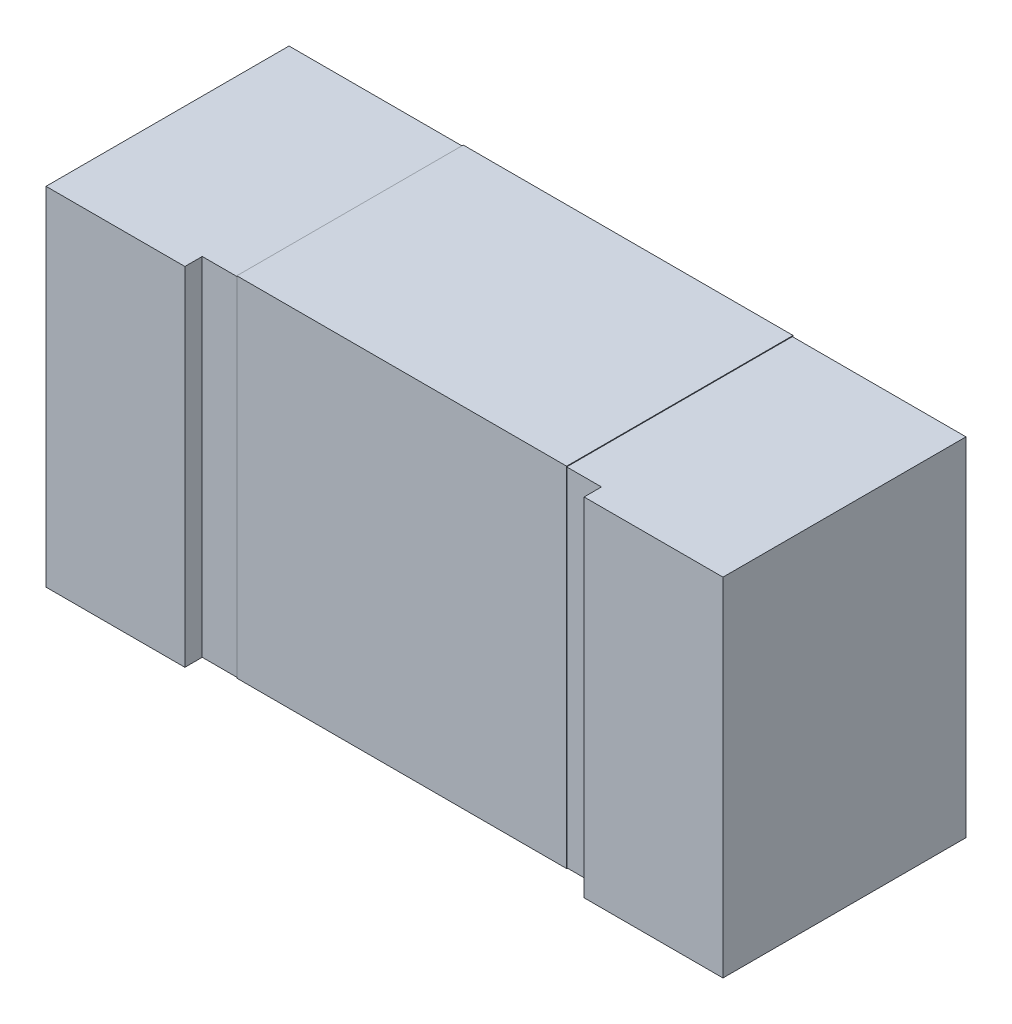
ISO-10303-21;
HEADER;
FILE_DESCRIPTION(('STEP AP214'),'2;1');
FILE_NAME('part.step','',(''),(''),'','','');
FILE_SCHEMA(('AUTOMOTIVE_DESIGN { 1 0 10303 214 1 1 1 1 }'));
ENDSEC;
DATA;
#1=APPLICATION_CONTEXT('core data for automotive mechanical design processes');
#2=APPLICATION_PROTOCOL_DEFINITION('international standard','automotive_design',2000,#1);
#3=PRODUCT_CONTEXT('',#1,'mechanical');
#4=PRODUCT('Part','Part','',(#3));
#5=PRODUCT_RELATED_PRODUCT_CATEGORY('part','',(#4));
#6=PRODUCT_DEFINITION_FORMATION('','',#4);
#7=PRODUCT_DEFINITION_CONTEXT('part definition',#1,'design');
#8=PRODUCT_DEFINITION('design','',#6,#7);
#9=PRODUCT_DEFINITION_SHAPE('','',#8);
#10=(LENGTH_UNIT() NAMED_UNIT(*) SI_UNIT(.MILLI.,.METRE.));
#11=(NAMED_UNIT(*) PLANE_ANGLE_UNIT() SI_UNIT($,.RADIAN.));
#12=(NAMED_UNIT(*) SI_UNIT($,.STERADIAN.) SOLID_ANGLE_UNIT());
#13=UNCERTAINTY_MEASURE_WITH_UNIT(LENGTH_MEASURE(1.E-05),#10,'distance_accuracy_value','');
#14=(GEOMETRIC_REPRESENTATION_CONTEXT(3) GLOBAL_UNCERTAINTY_ASSIGNED_CONTEXT((#13)) GLOBAL_UNIT_ASSIGNED_CONTEXT((#10,
#11,#12)) REPRESENTATION_CONTEXT('',''));
#15=CARTESIAN_POINT('',(0.,0.,0.));
#16=DIRECTION('',(0.,0.,1.));
#17=DIRECTION('',(1.,0.,0.));
#18=AXIS2_PLACEMENT_3D('',#15,#16,#17);
#19=CARTESIAN_POINT('',(-0.4699,-0.254,0.3302));
#20=DIRECTION('',(0.,0.,1.));
#21=DIRECTION('',(1.,0.,0.));
#22=AXIS2_PLACEMENT_3D('',#19,#20,#21);
#23=PLANE('',#22);
#24=DIRECTION('',(1.,0.,0.));
#25=VECTOR('',#24,1.);
#26=CARTESIAN_POINT('',(-0.4699,0.254,0.3302));
#27=LINE('',#26,#25);
#28=CARTESIAN_POINT('',(0.2413,0.254,0.3302));
#29=VERTEX_POINT('',#28);
#30=CARTESIAN_POINT('',(0.2921,0.254,0.3302));
#31=VERTEX_POINT('',#30);
#32=EDGE_CURVE('E227',#29,#31,#27,.T.);
#33=ORIENTED_EDGE('',*,*,#32,.F.);
#34=DIRECTION('',(0.,-1.,0.));
#35=VECTOR('',#34,1.);
#36=CARTESIAN_POINT('',(0.2413,-0.254,0.3302));
#37=LINE('',#36,#35);
#38=CARTESIAN_POINT('',(0.2413,-0.254,0.3302));
#39=VERTEX_POINT('',#38);
#40=EDGE_CURVE('E172',#29,#39,#37,.T.);
#41=ORIENTED_EDGE('',*,*,#40,.T.);
#42=DIRECTION('',(1.,0.,0.));
#43=VECTOR('',#42,1.);
#44=CARTESIAN_POINT('',(-0.4699,-0.254,0.3302));
#45=LINE('',#44,#43);
#46=CARTESIAN_POINT('',(0.2921,-0.254,0.3302));
#47=VERTEX_POINT('',#46);
#48=EDGE_CURVE('E232',#39,#47,#45,.T.);
#49=ORIENTED_EDGE('',*,*,#48,.T.);
#50=DIRECTION('',(0.,-1.,0.));
#51=VECTOR('',#50,1.);
#52=CARTESIAN_POINT('',(0.2921,0.254,0.3302));
#53=LINE('',#52,#51);
#54=EDGE_CURVE('E218',#31,#47,#53,.T.);
#55=ORIENTED_EDGE('',*,*,#54,.F.);
#56=EDGE_LOOP('',(#33,#41,#49,#55));
#57=FACE_BOUND('',#56,.T.);
#58=ADVANCED_FACE('F34',(#57),#23,.T.);
#59=CARTESIAN_POINT('',(0.,0.254,0.));
#60=DIRECTION('',(0.,-1.,0.));
#61=DIRECTION('',(0.,0.,-1.));
#62=AXIS2_PLACEMENT_3D('',#59,#60,#61);
#63=PLANE('',#62);
#64=DIRECTION('',(0.,0.,1.));
#65=VECTOR('',#64,1.);
#66=CARTESIAN_POINT('',(0.2413,0.254,0.));
#67=LINE('',#66,#65);
#68=CARTESIAN_POINT('',(0.2413,0.254,0.));
#69=VERTEX_POINT('',#68);
#70=EDGE_CURVE('E49',#69,#29,#67,.T.);
#71=ORIENTED_EDGE('',*,*,#70,.T.);
#72=ORIENTED_EDGE('',*,*,#32,.T.);
#73=DIRECTION('',(0.,0.,1.));
#74=VECTOR('',#73,1.);
#75=CARTESIAN_POINT('',(0.2921,0.254,0.3302));
#76=LINE('',#75,#74);
#77=CARTESIAN_POINT('',(0.2921,0.254,0.3556));
#78=VERTEX_POINT('',#77);
#79=EDGE_CURVE('E198',#31,#78,#76,.T.);
#80=ORIENTED_EDGE('',*,*,#79,.T.);
#81=DIRECTION('',(1.,0.,0.));
#82=VECTOR('',#81,1.);
#83=CARTESIAN_POINT('',(0.2921,0.254,0.3556));
#84=LINE('',#83,#82);
#85=CARTESIAN_POINT('',(0.4953,0.254,0.3556));
#86=VERTEX_POINT('',#85);
#87=EDGE_CURVE('E200',#78,#86,#84,.T.);
#88=ORIENTED_EDGE('',*,*,#87,.T.);
#89=DIRECTION('',(0.,0.,-1.));
#90=VECTOR('',#89,1.);
#91=CARTESIAN_POINT('',(0.4953,0.254,0.3556));
#92=LINE('',#91,#90);
#93=CARTESIAN_POINT('',(0.4953,0.254,0.));
#94=VERTEX_POINT('',#93);
#95=EDGE_CURVE('E191',#86,#94,#92,.T.);
#96=ORIENTED_EDGE('',*,*,#95,.T.);
#97=DIRECTION('',(-1.,0.,0.));
#98=VECTOR('',#97,1.);
#99=CARTESIAN_POINT('',(0.4953,0.254,0.));
#100=LINE('',#99,#98);
#101=EDGE_CURVE('E194',#94,#69,#100,.T.);
#102=ORIENTED_EDGE('',*,*,#101,.T.);
#103=EDGE_LOOP('',(#71,#72,#80,#88,#96,#102));
#104=FACE_BOUND('',#103,.T.);
#105=ADVANCED_FACE('F305',(#104),#63,.F.);
#106=CARTESIAN_POINT('',(0.,-0.254,0.));
#107=DIRECTION('',(0.,-1.,0.));
#108=DIRECTION('',(0.,0.,-1.));
#109=AXIS2_PLACEMENT_3D('',#106,#107,#108);
#110=PLANE('',#109);
#111=ORIENTED_EDGE('',*,*,#48,.F.);
#112=DIRECTION('',(0.,0.,1.));
#113=VECTOR('',#112,1.);
#114=CARTESIAN_POINT('',(0.2413,-0.254,0.));
#115=LINE('',#114,#113);
#116=CARTESIAN_POINT('',(0.2413,-0.254,0.));
#117=VERTEX_POINT('',#116);
#118=EDGE_CURVE('E208',#117,#39,#115,.T.);
#119=ORIENTED_EDGE('',*,*,#118,.F.);
#120=DIRECTION('',(-1.,0.,0.));
#121=VECTOR('',#120,1.);
#122=CARTESIAN_POINT('',(0.4953,-0.254,0.));
#123=LINE('',#122,#121);
#124=CARTESIAN_POINT('',(0.4953,-0.254,0.));
#125=VERTEX_POINT('',#124);
#126=EDGE_CURVE('E205',#125,#117,#123,.T.);
#127=ORIENTED_EDGE('',*,*,#126,.F.);
#128=DIRECTION('',(0.,0.,-1.));
#129=VECTOR('',#128,1.);
#130=CARTESIAN_POINT('',(0.4953,-0.254,0.3556));
#131=LINE('',#130,#129);
#132=CARTESIAN_POINT('',(0.4953,-0.254,0.3556));
#133=VERTEX_POINT('',#132);
#134=EDGE_CURVE('E190',#133,#125,#131,.T.);
#135=ORIENTED_EDGE('',*,*,#134,.F.);
#136=DIRECTION('',(1.,0.,0.));
#137=VECTOR('',#136,1.);
#138=CARTESIAN_POINT('',(0.2921,-0.254,0.3556));
#139=LINE('',#138,#137);
#140=CARTESIAN_POINT('',(0.2921,-0.254,0.3556));
#141=VERTEX_POINT('',#140);
#142=EDGE_CURVE('E195',#141,#133,#139,.T.);
#143=ORIENTED_EDGE('',*,*,#142,.F.);
#144=DIRECTION('',(0.,0.,1.));
#145=VECTOR('',#144,1.);
#146=CARTESIAN_POINT('',(0.2921,-0.254,0.3302));
#147=LINE('',#146,#145);
#148=EDGE_CURVE('E210',#47,#141,#147,.T.);
#149=ORIENTED_EDGE('',*,*,#148,.F.);
#150=EDGE_LOOP('',(#111,#119,#127,#135,#143,#149));
#151=FACE_BOUND('',#150,.T.);
#152=ADVANCED_FACE('F311',(#151),#110,.T.);
#153=CARTESIAN_POINT('',(0.4953,0.254,0.3556));
#154=DIRECTION('',(-1.,0.,0.));
#155=DIRECTION('',(0.,0.,1.));
#156=AXIS2_PLACEMENT_3D('',#153,#154,#155);
#157=PLANE('',#156);
#158=ORIENTED_EDGE('',*,*,#134,.T.);
#159=DIRECTION('',(0.,-1.,0.));
#160=VECTOR('',#159,1.);
#161=CARTESIAN_POINT('',(0.4953,0.254,0.));
#162=LINE('',#161,#160);
#163=EDGE_CURVE('E224',#94,#125,#162,.T.);
#164=ORIENTED_EDGE('',*,*,#163,.F.);
#165=ORIENTED_EDGE('',*,*,#95,.F.);
#166=DIRECTION('',(0.,-1.,0.));
#167=VECTOR('',#166,1.);
#168=CARTESIAN_POINT('',(0.4953,0.254,0.3556));
#169=LINE('',#168,#167);
#170=EDGE_CURVE('E202',#86,#133,#169,.T.);
#171=ORIENTED_EDGE('',*,*,#170,.T.);
#172=EDGE_LOOP('',(#158,#164,#165,#171));
#173=FACE_BOUND('',#172,.T.);
#174=ADVANCED_FACE('F327',(#173),#157,.F.);
#175=CARTESIAN_POINT('',(0.4953,0.254,0.));
#176=DIRECTION('',(0.,0.,1.));
#177=DIRECTION('',(1.,0.,0.));
#178=AXIS2_PLACEMENT_3D('',#175,#176,#177);
#179=PLANE('',#178);
#180=ORIENTED_EDGE('',*,*,#126,.T.);
#181=DIRECTION('',(0.,-1.,0.));
#182=VECTOR('',#181,1.);
#183=CARTESIAN_POINT('',(0.2413,0.254,0.));
#184=LINE('',#183,#182);
#185=EDGE_CURVE('E221',#69,#117,#184,.T.);
#186=ORIENTED_EDGE('',*,*,#185,.F.);
#187=ORIENTED_EDGE('',*,*,#101,.F.);
#188=ORIENTED_EDGE('',*,*,#163,.T.);
#189=EDGE_LOOP('',(#180,#186,#187,#188));
#190=FACE_BOUND('',#189,.T.);
#191=ADVANCED_FACE('F332',(#190),#179,.F.);
#192=CARTESIAN_POINT('',(0.2921,0.254,0.3302));
#193=DIRECTION('',(1.,0.,0.));
#194=DIRECTION('',(0.,0.,-1.));
#195=AXIS2_PLACEMENT_3D('',#192,#193,#194);
#196=PLANE('',#195);
#197=ORIENTED_EDGE('',*,*,#148,.T.);
#198=DIRECTION('',(0.,-1.,0.));
#199=VECTOR('',#198,1.);
#200=CARTESIAN_POINT('',(0.2921,0.254,0.3556));
#201=LINE('',#200,#199);
#202=EDGE_CURVE('E215',#78,#141,#201,.T.);
#203=ORIENTED_EDGE('',*,*,#202,.F.);
#204=ORIENTED_EDGE('',*,*,#79,.F.);
#205=ORIENTED_EDGE('',*,*,#54,.T.);
#206=EDGE_LOOP('',(#197,#203,#204,#205));
#207=FACE_BOUND('',#206,.T.);
#208=ADVANCED_FACE('F301',(#207),#196,.F.);
#209=CARTESIAN_POINT('',(0.2921,0.254,0.3556));
#210=DIRECTION('',(0.,0.,-1.));
#211=DIRECTION('',(-1.,0.,0.));
#212=AXIS2_PLACEMENT_3D('',#209,#210,#211);
#213=PLANE('',#212);
#214=ORIENTED_EDGE('',*,*,#142,.T.);
#215=ORIENTED_EDGE('',*,*,#170,.F.);
#216=ORIENTED_EDGE('',*,*,#87,.F.);
#217=ORIENTED_EDGE('',*,*,#202,.T.);
#218=EDGE_LOOP('',(#214,#215,#216,#217));
#219=FACE_BOUND('',#218,.T.);
#220=ADVANCED_FACE('F292',(#219),#213,.F.);
#221=CARTESIAN_POINT('',(-0.2413,0.254,0.));
#222=DIRECTION('',(-1.,0.,0.));
#223=DIRECTION('',(0.,0.,1.));
#224=AXIS2_PLACEMENT_3D('',#221,#222,#223);
#225=PLANE('',#224);
#226=DIRECTION('',(0.,0.,-1.));
#227=VECTOR('',#226,1.);
#228=CARTESIAN_POINT('',(-0.2413,0.255,-0.00099999999999994));
#229=LINE('',#228,#227);
#230=CARTESIAN_POINT('',(-0.2413,0.255,0.330359425168108));
#231=VERTEX_POINT('',#230);
#232=CARTESIAN_POINT('',(-0.2413,0.255,-0.00099999999999994));
#233=VERTEX_POINT('',#232);
#234=EDGE_CURVE('E161',#231,#233,#229,.T.);
#235=ORIENTED_EDGE('',*,*,#234,.T.);
#236=DIRECTION('',(0.,-1.,0.));
#237=VECTOR('',#236,1.);
#238=CARTESIAN_POINT('',(-0.2413,0.255,-0.00099999999999994));
#239=LINE('',#238,#237);
#240=CARTESIAN_POINT('',(-0.2413,-0.255,-0.000999999999999877));
#241=VERTEX_POINT('',#240);
#242=EDGE_CURVE('E167',#233,#241,#239,.T.);
#243=ORIENTED_EDGE('',*,*,#242,.T.);
#244=DIRECTION('',(0.,0.,1.));
#245=VECTOR('',#244,1.);
#246=CARTESIAN_POINT('',(-0.2413,-0.255,-0.000999999999999877));
#247=LINE('',#246,#245);
#248=CARTESIAN_POINT('',(-0.2413,-0.255,0.330359425168108));
#249=VERTEX_POINT('',#248);
#250=EDGE_CURVE('E171',#241,#249,#247,.T.);
#251=ORIENTED_EDGE('',*,*,#250,.T.);
#252=DIRECTION('',(0.,1.,0.));
#253=VECTOR('',#252,1.);
#254=CARTESIAN_POINT('',(-0.2413,0.255,0.330359425168108));
#255=LINE('',#254,#253);
#256=EDGE_CURVE('E151',#249,#231,#255,.T.);
#257=ORIENTED_EDGE('',*,*,#256,.T.);
#258=EDGE_LOOP('',(#235,#243,#251,#257));
#259=FACE_BOUND('',#258,.T.);
#260=DIRECTION('',(0.,0.,-1.));
#261=VECTOR('',#260,1.);
#262=CARTESIAN_POINT('',(-0.2413,0.254,0.));
#263=LINE('',#262,#261);
#264=CARTESIAN_POINT('',(-0.2413,0.254,0.3302));
#265=VERTEX_POINT('',#264);
#266=CARTESIAN_POINT('',(-0.2413,0.254,0.));
#267=VERTEX_POINT('',#266);
#268=EDGE_CURVE('E57',#265,#267,#263,.T.);
#269=ORIENTED_EDGE('',*,*,#268,.F.);
#270=DIRECTION('',(0.,-1.,0.));
#271=VECTOR('',#270,1.);
#272=CARTESIAN_POINT('',(-0.2413,-0.254,0.3302));
#273=LINE('',#272,#271);
#274=CARTESIAN_POINT('',(-0.2413,-0.254,0.3302));
#275=VERTEX_POINT('',#274);
#276=EDGE_CURVE('E175',#265,#275,#273,.T.);
#277=ORIENTED_EDGE('',*,*,#276,.T.);
#278=DIRECTION('',(0.,0.,-1.));
#279=VECTOR('',#278,1.);
#280=CARTESIAN_POINT('',(-0.2413,-0.254,0.));
#281=LINE('',#280,#279);
#282=CARTESIAN_POINT('',(-0.2413,-0.254,0.));
#283=VERTEX_POINT('',#282);
#284=EDGE_CURVE('E240',#275,#283,#281,.T.);
#285=ORIENTED_EDGE('',*,*,#284,.T.);
#286=DIRECTION('',(0.,-1.,0.));
#287=VECTOR('',#286,1.);
#288=CARTESIAN_POINT('',(-0.2413,0.254,0.));
#289=LINE('',#288,#287);
#290=EDGE_CURVE('E247',#267,#283,#289,.T.);
#291=ORIENTED_EDGE('',*,*,#290,.F.);
#292=EDGE_LOOP('',(#269,#277,#285,#291));
#293=FACE_BOUND('',#292,.T.);
#294=ADVANCED_FACE('F170',(#259,#293),#225,.T.);
#295=CARTESIAN_POINT('',(-0.849493282310598,0.255,-0.00099999999999994));
#296=DIRECTION('',(0.,0.,1.));
#297=DIRECTION('',(0.,-1.,0.));
#298=AXIS2_PLACEMENT_3D('',#295,#296,#297);
#299=PLANE('',#298);
#300=ORIENTED_EDGE('',*,*,#242,.F.);
#301=DIRECTION('',(1.,0.,0.));
#302=VECTOR('',#301,1.);
#303=CARTESIAN_POINT('',(-0.849493282310598,0.255,-0.00099999999999994));
#304=LINE('',#303,#302);
#305=CARTESIAN_POINT('',(0.2413,0.255,-0.00099999999999994));
#306=VERTEX_POINT('',#305);
#307=EDGE_CURVE('E163',#233,#306,#304,.T.);
#308=ORIENTED_EDGE('',*,*,#307,.T.);
#309=DIRECTION('',(0.,-1.,0.));
#310=VECTOR('',#309,1.);
#311=CARTESIAN_POINT('',(0.2413,0.255,-0.00099999999999994));
#312=LINE('',#311,#310);
#313=CARTESIAN_POINT('',(0.2413,-0.255,-0.000999999999999877));
#314=VERTEX_POINT('',#313);
#315=EDGE_CURVE('E179',#306,#314,#312,.T.);
#316=ORIENTED_EDGE('',*,*,#315,.T.);
#317=DIRECTION('',(1.,0.,0.));
#318=VECTOR('',#317,1.);
#319=CARTESIAN_POINT('',(-0.849493282310598,-0.255,-0.000999999999999877));
#320=LINE('',#319,#318);
#321=EDGE_CURVE('E183',#241,#314,#320,.T.);
#322=ORIENTED_EDGE('',*,*,#321,.F.);
#323=EDGE_LOOP('',(#300,#308,#316,#322));
#324=FACE_BOUND('',#323,.T.);
#325=ADVANCED_FACE('F291',(#324),#299,.F.);
#326=CARTESIAN_POINT('',(-0.849493282310598,-0.255,-0.000999999999999877));
#327=DIRECTION('',(0.,1.,0.));
#328=DIRECTION('',(0.,0.,1.));
#329=AXIS2_PLACEMENT_3D('',#326,#327,#328);
#330=PLANE('',#329);
#331=ORIENTED_EDGE('',*,*,#250,.F.);
#332=ORIENTED_EDGE('',*,*,#321,.T.);
#333=DIRECTION('',(0.,0.,1.));
#334=VECTOR('',#333,1.);
#335=CARTESIAN_POINT('',(0.2413,-0.255,-0.000999999999999877));
#336=LINE('',#335,#334);
#337=CARTESIAN_POINT('',(0.2413,-0.255,0.330359425168108));
#338=VERTEX_POINT('',#337);
#339=EDGE_CURVE('E185',#314,#338,#336,.T.);
#340=ORIENTED_EDGE('',*,*,#339,.T.);
#341=DIRECTION('',(1.,0.,0.));
#342=VECTOR('',#341,1.);
#343=CARTESIAN_POINT('',(-0.849493282310598,-0.255,0.330359425168108));
#344=LINE('',#343,#342);
#345=EDGE_CURVE('E186',#249,#338,#344,.T.);
#346=ORIENTED_EDGE('',*,*,#345,.F.);
#347=EDGE_LOOP('',(#331,#332,#340,#346));
#348=FACE_BOUND('',#347,.T.);
#349=ADVANCED_FACE('F298',(#348),#330,.F.);
#350=CARTESIAN_POINT('',(-0.849493282310598,0.255,0.330359425168108));
#351=DIRECTION('',(0.,0.,-1.));
#352=DIRECTION('',(0.,1.,0.));
#353=AXIS2_PLACEMENT_3D('',#350,#351,#352);
#354=PLANE('',#353);
#355=ORIENTED_EDGE('',*,*,#256,.F.);
#356=ORIENTED_EDGE('',*,*,#345,.T.);
#357=DIRECTION('',(0.,1.,0.));
#358=VECTOR('',#357,1.);
#359=CARTESIAN_POINT('',(0.2413,0.255,0.330359425168108));
#360=LINE('',#359,#358);
#361=CARTESIAN_POINT('',(0.2413,0.255,0.330359425168108));
#362=VERTEX_POINT('',#361);
#363=EDGE_CURVE('E154',#338,#362,#360,.T.);
#364=ORIENTED_EDGE('',*,*,#363,.T.);
#365=DIRECTION('',(1.,0.,0.));
#366=VECTOR('',#365,1.);
#367=CARTESIAN_POINT('',(-0.849493282310598,0.255,0.330359425168108));
#368=LINE('',#367,#366);
#369=EDGE_CURVE('E147',#231,#362,#368,.T.);
#370=ORIENTED_EDGE('',*,*,#369,.F.);
#371=EDGE_LOOP('',(#355,#356,#364,#370));
#372=FACE_BOUND('',#371,.T.);
#373=ADVANCED_FACE('F149',(#372),#354,.F.);
#374=CARTESIAN_POINT('',(-0.849493282310598,0.255,-0.00099999999999994));
#375=DIRECTION('',(0.,-1.,0.));
#376=DIRECTION('',(0.,0.,-1.));
#377=AXIS2_PLACEMENT_3D('',#374,#375,#376);
#378=PLANE('',#377);
#379=ORIENTED_EDGE('',*,*,#234,.F.);
#380=ORIENTED_EDGE('',*,*,#369,.T.);
#381=DIRECTION('',(0.,0.,-1.));
#382=VECTOR('',#381,1.);
#383=CARTESIAN_POINT('',(0.2413,0.255,-0.00099999999999994));
#384=LINE('',#383,#382);
#385=EDGE_CURVE('E158',#362,#306,#384,.T.);
#386=ORIENTED_EDGE('',*,*,#385,.T.);
#387=ORIENTED_EDGE('',*,*,#307,.F.);
#388=EDGE_LOOP('',(#379,#380,#386,#387));
#389=FACE_BOUND('',#388,.T.);
#390=ADVANCED_FACE('F162',(#389),#378,.F.);
#391=CARTESIAN_POINT('',(0.2413,0.,0.));
#392=DIRECTION('',(-1.,0.,0.));
#393=DIRECTION('',(0.,0.,1.));
#394=AXIS2_PLACEMENT_3D('',#391,#392,#393);
#395=PLANE('',#394);
#396=ORIENTED_EDGE('',*,*,#40,.F.);
#397=ORIENTED_EDGE('',*,*,#70,.F.);
#398=ORIENTED_EDGE('',*,*,#185,.T.);
#399=ORIENTED_EDGE('',*,*,#118,.T.);
#400=EDGE_LOOP('',(#396,#397,#398,#399));
#401=FACE_BOUND('',#400,.T.);
#402=ORIENTED_EDGE('',*,*,#315,.F.);
#403=ORIENTED_EDGE('',*,*,#385,.F.);
#404=ORIENTED_EDGE('',*,*,#363,.F.);
#405=ORIENTED_EDGE('',*,*,#339,.F.);
#406=EDGE_LOOP('',(#402,#403,#404,#405));
#407=FACE_BOUND('',#406,.T.);
#408=ADVANCED_FACE('F345',(#401,#407),#395,.F.);
#409=CARTESIAN_POINT('',(-0.4953,0.254,0.3556));
#410=DIRECTION('',(1.,0.,0.));
#411=DIRECTION('',(0.,0.,-1.));
#412=AXIS2_PLACEMENT_3D('',#409,#410,#411);
#413=PLANE('',#412);
#414=DIRECTION('',(0.,0.,1.));
#415=VECTOR('',#414,1.);
#416=CARTESIAN_POINT('',(-0.4953,-0.254,0.3556));
#417=LINE('',#416,#415);
#418=CARTESIAN_POINT('',(-0.4953,-0.254,0.));
#419=VERTEX_POINT('',#418);
#420=CARTESIAN_POINT('',(-0.4953,-0.254,0.3556));
#421=VERTEX_POINT('',#420);
#422=EDGE_CURVE('E250',#419,#421,#417,.T.);
#423=ORIENTED_EDGE('',*,*,#422,.T.);
#424=DIRECTION('',(0.,-1.,0.));
#425=VECTOR('',#424,1.);
#426=CARTESIAN_POINT('',(-0.4953,0.254,0.3556));
#427=LINE('',#426,#425);
#428=CARTESIAN_POINT('',(-0.4953,0.254,0.3556));
#429=VERTEX_POINT('',#428);
#430=EDGE_CURVE('E42',#429,#421,#427,.T.);
#431=ORIENTED_EDGE('',*,*,#430,.F.);
#432=DIRECTION('',(0.,0.,1.));
#433=VECTOR('',#432,1.);
#434=CARTESIAN_POINT('',(-0.4953,0.254,0.3556));
#435=LINE('',#434,#433);
#436=CARTESIAN_POINT('',(-0.4953,0.254,0.));
#437=VERTEX_POINT('',#436);
#438=EDGE_CURVE('E239',#437,#429,#435,.T.);
#439=ORIENTED_EDGE('',*,*,#438,.F.);
#440=DIRECTION('',(0.,-1.,0.));
#441=VECTOR('',#440,1.);
#442=CARTESIAN_POINT('',(-0.4953,0.254,0.));
#443=LINE('',#442,#441);
#444=EDGE_CURVE('E11',#437,#419,#443,.T.);
#445=ORIENTED_EDGE('',*,*,#444,.T.);
#446=EDGE_LOOP('',(#423,#431,#439,#445));
#447=FACE_BOUND('',#446,.T.);
#448=ADVANCED_FACE('F288',(#447),#413,.F.);
#449=CARTESIAN_POINT('',(-0.2921,0.254,0.3556));
#450=DIRECTION('',(0.,0.,-1.));
#451=DIRECTION('',(-1.,0.,0.));
#452=AXIS2_PLACEMENT_3D('',#449,#450,#451);
#453=PLANE('',#452);
#454=DIRECTION('',(1.,0.,0.));
#455=VECTOR('',#454,1.);
#456=CARTESIAN_POINT('',(-0.2921,-0.254,0.3556));
#457=LINE('',#456,#455);
#458=CARTESIAN_POINT('',(-0.2921,-0.254,0.3556));
#459=VERTEX_POINT('',#458);
#460=EDGE_CURVE('E252',#421,#459,#457,.T.);
#461=ORIENTED_EDGE('',*,*,#460,.T.);
#462=DIRECTION('',(0.,-1.,0.));
#463=VECTOR('',#462,1.);
#464=CARTESIAN_POINT('',(-0.2921,0.254,0.3556));
#465=LINE('',#464,#463);
#466=CARTESIAN_POINT('',(-0.2921,0.254,0.3556));
#467=VERTEX_POINT('',#466);
#468=EDGE_CURVE('E263',#467,#459,#465,.T.);
#469=ORIENTED_EDGE('',*,*,#468,.F.);
#470=DIRECTION('',(1.,0.,0.));
#471=VECTOR('',#470,1.);
#472=CARTESIAN_POINT('',(-0.2921,0.254,0.3556));
#473=LINE('',#472,#471);
#474=EDGE_CURVE('E242',#429,#467,#473,.T.);
#475=ORIENTED_EDGE('',*,*,#474,.F.);
#476=ORIENTED_EDGE('',*,*,#430,.T.);
#477=EDGE_LOOP('',(#461,#469,#475,#476));
#478=FACE_BOUND('',#477,.T.);
#479=ADVANCED_FACE('F270',(#478),#453,.F.);
#480=CARTESIAN_POINT('',(-0.2921,0.254,0.3302));
#481=DIRECTION('',(-1.,0.,0.));
#482=DIRECTION('',(0.,0.,1.));
#483=AXIS2_PLACEMENT_3D('',#480,#481,#482);
#484=PLANE('',#483);
#485=DIRECTION('',(0.,0.,-1.));
#486=VECTOR('',#485,1.);
#487=CARTESIAN_POINT('',(-0.2921,-0.254,0.3302));
#488=LINE('',#487,#486);
#489=CARTESIAN_POINT('',(-0.2921,-0.254,0.3302));
#490=VERTEX_POINT('',#489);
#491=EDGE_CURVE('E254',#459,#490,#488,.T.);
#492=ORIENTED_EDGE('',*,*,#491,.T.);
#493=DIRECTION('',(0.,-1.,0.));
#494=VECTOR('',#493,1.);
#495=CARTESIAN_POINT('',(-0.2921,0.254,0.3302));
#496=LINE('',#495,#494);
#497=CARTESIAN_POINT('',(-0.2921,0.254,0.3302));
#498=VERTEX_POINT('',#497);
#499=EDGE_CURVE('E260',#498,#490,#496,.T.);
#500=ORIENTED_EDGE('',*,*,#499,.F.);
#501=DIRECTION('',(0.,0.,-1.));
#502=VECTOR('',#501,1.);
#503=CARTESIAN_POINT('',(-0.2921,0.254,0.3302));
#504=LINE('',#503,#502);
#505=EDGE_CURVE('E244',#467,#498,#504,.T.);
#506=ORIENTED_EDGE('',*,*,#505,.F.);
#507=ORIENTED_EDGE('',*,*,#468,.T.);
#508=EDGE_LOOP('',(#492,#500,#506,#507));
#509=FACE_BOUND('',#508,.T.);
#510=ADVANCED_FACE('F279',(#509),#484,.F.);
#511=EDGE_CURVE('E233',#498,#265,#27,.T.);
#512=ORIENTED_EDGE('',*,*,#511,.T.);
#513=ORIENTED_EDGE('',*,*,#268,.T.);
#514=DIRECTION('',(-1.,0.,0.));
#515=VECTOR('',#514,1.);
#516=CARTESIAN_POINT('',(-0.4953,0.254,0.));
#517=LINE('',#516,#515);
#518=EDGE_CURVE('E236',#267,#437,#517,.T.);
#519=ORIENTED_EDGE('',*,*,#518,.T.);
#520=ORIENTED_EDGE('',*,*,#438,.T.);
#521=ORIENTED_EDGE('',*,*,#474,.T.);
#522=ORIENTED_EDGE('',*,*,#505,.T.);
#523=EDGE_LOOP('',(#512,#513,#519,#520,#521,#522));
#524=FACE_BOUND('',#523,.T.);
#525=ADVANCED_FACE('F285',(#524),#63,.F.);
#526=ORIENTED_EDGE('',*,*,#284,.F.);
#527=EDGE_CURVE('E228',#490,#275,#45,.T.);
#528=ORIENTED_EDGE('',*,*,#527,.F.);
#529=ORIENTED_EDGE('',*,*,#491,.F.);
#530=ORIENTED_EDGE('',*,*,#460,.F.);
#531=ORIENTED_EDGE('',*,*,#422,.F.);
#532=DIRECTION('',(-1.,0.,0.));
#533=VECTOR('',#532,1.);
#534=CARTESIAN_POINT('',(-0.4953,-0.254,0.));
#535=LINE('',#534,#533);
#536=EDGE_CURVE('E231',#283,#419,#535,.T.);
#537=ORIENTED_EDGE('',*,*,#536,.F.);
#538=EDGE_LOOP('',(#526,#528,#529,#530,#531,#537));
#539=FACE_BOUND('',#538,.T.);
#540=ADVANCED_FACE('F275',(#539),#110,.T.);
#541=CARTESIAN_POINT('',(-0.4953,0.254,0.));
#542=DIRECTION('',(0.,0.,1.));
#543=DIRECTION('',(1.,0.,0.));
#544=AXIS2_PLACEMENT_3D('',#541,#542,#543);
#545=PLANE('',#544);
#546=ORIENTED_EDGE('',*,*,#536,.T.);
#547=ORIENTED_EDGE('',*,*,#444,.F.);
#548=ORIENTED_EDGE('',*,*,#518,.F.);
#549=ORIENTED_EDGE('',*,*,#290,.T.);
#550=EDGE_LOOP('',(#546,#547,#548,#549));
#551=FACE_BOUND('',#550,.T.);
#552=ADVANCED_FACE('F36',(#551),#545,.F.);
#553=ORIENTED_EDGE('',*,*,#276,.F.);
#554=ORIENTED_EDGE('',*,*,#511,.F.);
#555=ORIENTED_EDGE('',*,*,#499,.T.);
#556=ORIENTED_EDGE('',*,*,#527,.T.);
#557=EDGE_LOOP('',(#553,#554,#555,#556));
#558=FACE_BOUND('',#557,.T.);
#559=ADVANCED_FACE('F283',(#558),#23,.T.);
#560=CLOSED_SHELL('',(#58,#105,#152,#174,#191,#208,#220,#294,#325,#349,#373,#390,#408,#448,#479,
#510,#525,#540,#552,#559));
#561=MANIFOLD_SOLID_BREP('B2',#560);
#562=ADVANCED_BREP_SHAPE_REPRESENTATION('',(#18,#561),#14);
#563=SHAPE_DEFINITION_REPRESENTATION(#9,#562);
ENDSEC;
END-ISO-10303-21;
